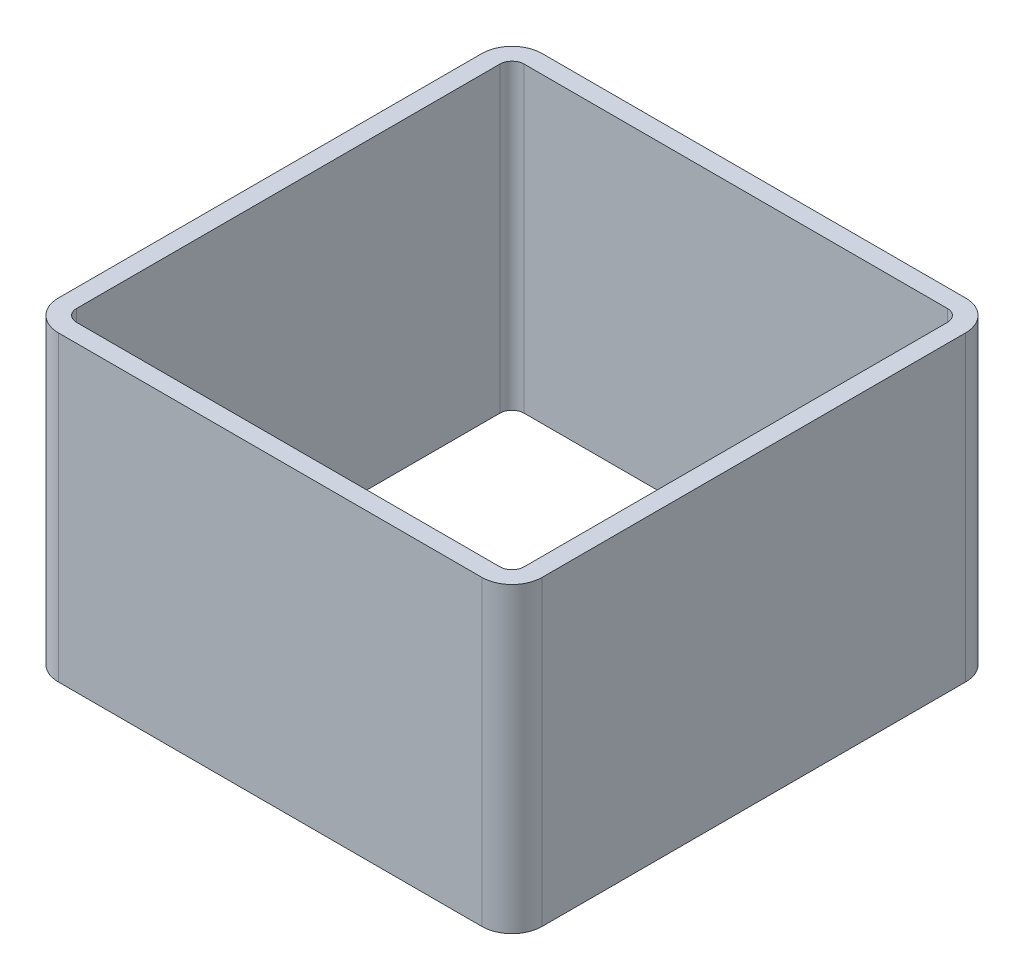
ISO-10303-21;
HEADER;
FILE_DESCRIPTION(('STEP AP214'),'2;1');
FILE_NAME('part.step','',(''),(''),'','','');
FILE_SCHEMA(('AUTOMOTIVE_DESIGN { 1 0 10303 214 1 1 1 1 }'));
ENDSEC;
DATA;
#1=APPLICATION_CONTEXT('core data for automotive mechanical design processes');
#2=APPLICATION_PROTOCOL_DEFINITION('international standard','automotive_design',2000,#1);
#3=PRODUCT_CONTEXT('',#1,'mechanical');
#4=PRODUCT('Part','Part','',(#3));
#5=PRODUCT_RELATED_PRODUCT_CATEGORY('part','',(#4));
#6=PRODUCT_DEFINITION_FORMATION('','',#4);
#7=PRODUCT_DEFINITION_CONTEXT('part definition',#1,'design');
#8=PRODUCT_DEFINITION('design','',#6,#7);
#9=PRODUCT_DEFINITION_SHAPE('','',#8);
#10=(LENGTH_UNIT() NAMED_UNIT(*) SI_UNIT(.MILLI.,.METRE.));
#11=(NAMED_UNIT(*) PLANE_ANGLE_UNIT() SI_UNIT($,.RADIAN.));
#12=(NAMED_UNIT(*) SI_UNIT($,.STERADIAN.) SOLID_ANGLE_UNIT());
#13=UNCERTAINTY_MEASURE_WITH_UNIT(LENGTH_MEASURE(1.E-05),#10,'distance_accuracy_value','');
#14=(GEOMETRIC_REPRESENTATION_CONTEXT(3) GLOBAL_UNCERTAINTY_ASSIGNED_CONTEXT((#13)) GLOBAL_UNIT_ASSIGNED_CONTEXT((#10,
#11,#12)) REPRESENTATION_CONTEXT('',''));
#15=CARTESIAN_POINT('',(0.,0.,0.));
#16=DIRECTION('',(0.,0.,1.));
#17=DIRECTION('',(1.,0.,0.));
#18=AXIS2_PLACEMENT_3D('',#15,#16,#17);
#19=CARTESIAN_POINT('',(-35.,50.,35.));
#20=DIRECTION('',(0.,1.,0.));
#21=DIRECTION('',(0.,0.,1.));
#22=AXIS2_PLACEMENT_3D('',#19,#20,#21);
#23=PLANE('',#22);
#24=CARTESIAN_POINT('',(-35.,50.,35.));
#25=DIRECTION('',(0.,1.,0.));
#26=DIRECTION('',(0.,0.,1.));
#27=AXIS2_PLACEMENT_3D('',#24,#25,#26);
#28=CIRCLE('',#27,5.);
#29=CARTESIAN_POINT('',(-40.,50.,35.));
#30=VERTEX_POINT('',#29);
#31=CARTESIAN_POINT('',(-35.,50.,40.));
#32=VERTEX_POINT('',#31);
#33=EDGE_CURVE('E290',#30,#32,#28,.T.);
#34=ORIENTED_EDGE('',*,*,#33,.T.);
#35=DIRECTION('',(1.,0.,0.));
#36=VECTOR('',#35,1.);
#37=CARTESIAN_POINT('',(-35.,50.,40.));
#38=LINE('',#37,#36);
#39=CARTESIAN_POINT('',(35.,50.,40.));
#40=VERTEX_POINT('',#39);
#41=EDGE_CURVE('E294',#32,#40,#38,.T.);
#42=ORIENTED_EDGE('',*,*,#41,.T.);
#43=CARTESIAN_POINT('',(35.,50.,35.));
#44=DIRECTION('',(0.,1.,0.));
#45=DIRECTION('',(0.,0.,1.));
#46=AXIS2_PLACEMENT_3D('',#43,#44,#45);
#47=CIRCLE('',#46,5.);
#48=CARTESIAN_POINT('',(40.,50.,35.));
#49=VERTEX_POINT('',#48);
#50=EDGE_CURVE('E298',#40,#49,#47,.T.);
#51=ORIENTED_EDGE('',*,*,#50,.T.);
#52=DIRECTION('',(0.,0.,-1.));
#53=VECTOR('',#52,1.);
#54=CARTESIAN_POINT('',(40.,50.,-35.));
#55=LINE('',#54,#53);
#56=CARTESIAN_POINT('',(40.,50.,-35.));
#57=VERTEX_POINT('',#56);
#58=EDGE_CURVE('E301',#49,#57,#55,.T.);
#59=ORIENTED_EDGE('',*,*,#58,.T.);
#60=CARTESIAN_POINT('',(35.,50.,-35.));
#61=DIRECTION('',(0.,1.,0.));
#62=DIRECTION('',(0.,0.,-1.));
#63=AXIS2_PLACEMENT_3D('',#60,#61,#62);
#64=CIRCLE('',#63,5.);
#65=CARTESIAN_POINT('',(35.,50.,-40.));
#66=VERTEX_POINT('',#65);
#67=EDGE_CURVE('E304',#57,#66,#64,.T.);
#68=ORIENTED_EDGE('',*,*,#67,.T.);
#69=DIRECTION('',(-1.,0.,0.));
#70=VECTOR('',#69,1.);
#71=CARTESIAN_POINT('',(-35.,50.,-40.));
#72=LINE('',#71,#70);
#73=CARTESIAN_POINT('',(-35.,50.,-40.));
#74=VERTEX_POINT('',#73);
#75=EDGE_CURVE('E307',#66,#74,#72,.T.);
#76=ORIENTED_EDGE('',*,*,#75,.T.);
#77=CARTESIAN_POINT('',(-35.,50.,-35.));
#78=DIRECTION('',(0.,1.,0.));
#79=DIRECTION('',(0.,0.,1.));
#80=AXIS2_PLACEMENT_3D('',#77,#78,#79);
#81=CIRCLE('',#80,5.);
#82=CARTESIAN_POINT('',(-40.,50.,-35.));
#83=VERTEX_POINT('',#82);
#84=EDGE_CURVE('E310',#74,#83,#81,.T.);
#85=ORIENTED_EDGE('',*,*,#84,.T.);
#86=DIRECTION('',(0.,0.,1.));
#87=VECTOR('',#86,1.);
#88=CARTESIAN_POINT('',(-40.,50.,-35.));
#89=LINE('',#88,#87);
#90=EDGE_CURVE('E313',#83,#30,#89,.T.);
#91=ORIENTED_EDGE('',*,*,#90,.T.);
#92=EDGE_LOOP('',(#34,#42,#51,#59,#68,#76,#85,#91));
#93=FACE_BOUND('',#92,.T.);
#94=DIRECTION('',(1.,0.,0.));
#95=VECTOR('',#94,1.);
#96=CARTESIAN_POINT('',(-35.,50.,37.));
#97=LINE('',#96,#95);
#98=CARTESIAN_POINT('',(-35.,50.,37.));
#99=VERTEX_POINT('',#98);
#100=CARTESIAN_POINT('',(35.,50.,37.));
#101=VERTEX_POINT('',#100);
#102=EDGE_CURVE('E210',#99,#101,#97,.T.);
#103=ORIENTED_EDGE('',*,*,#102,.F.);
#104=CARTESIAN_POINT('',(-35.,50.,35.));
#105=DIRECTION('',(0.,1.,0.));
#106=DIRECTION('',(1.,0.,0.));
#107=AXIS2_PLACEMENT_3D('',#104,#105,#106);
#108=CIRCLE('',#107,2.);
#109=CARTESIAN_POINT('',(-37.,50.,35.));
#110=VERTEX_POINT('',#109);
#111=EDGE_CURVE('E201',#110,#99,#108,.T.);
#112=ORIENTED_EDGE('',*,*,#111,.F.);
#113=DIRECTION('',(0.,0.,1.));
#114=VECTOR('',#113,1.);
#115=CARTESIAN_POINT('',(-37.,50.,-35.));
#116=LINE('',#115,#114);
#117=CARTESIAN_POINT('',(-37.,50.,-35.));
#118=VERTEX_POINT('',#117);
#119=EDGE_CURVE('E242',#118,#110,#116,.T.);
#120=ORIENTED_EDGE('',*,*,#119,.F.);
#121=CARTESIAN_POINT('',(-35.,50.,-35.));
#122=DIRECTION('',(0.,1.,0.));
#123=DIRECTION('',(1.,0.,0.));
#124=AXIS2_PLACEMENT_3D('',#121,#122,#123);
#125=CIRCLE('',#124,2.);
#126=CARTESIAN_POINT('',(-35.,50.,-37.));
#127=VERTEX_POINT('',#126);
#128=EDGE_CURVE('E239',#127,#118,#125,.T.);
#129=ORIENTED_EDGE('',*,*,#128,.F.);
#130=DIRECTION('',(-1.,0.,0.));
#131=VECTOR('',#130,1.);
#132=CARTESIAN_POINT('',(-35.,50.,-37.));
#133=LINE('',#132,#131);
#134=CARTESIAN_POINT('',(35.,50.,-37.));
#135=VERTEX_POINT('',#134);
#136=EDGE_CURVE('E236',#135,#127,#133,.T.);
#137=ORIENTED_EDGE('',*,*,#136,.F.);
#138=CARTESIAN_POINT('',(35.,50.,-35.));
#139=DIRECTION('',(0.,1.,0.));
#140=DIRECTION('',(1.,0.,0.));
#141=AXIS2_PLACEMENT_3D('',#138,#139,#140);
#142=CIRCLE('',#141,2.);
#143=CARTESIAN_POINT('',(37.,50.,-35.));
#144=VERTEX_POINT('',#143);
#145=EDGE_CURVE('E233',#144,#135,#142,.T.);
#146=ORIENTED_EDGE('',*,*,#145,.F.);
#147=DIRECTION('',(0.,0.,-1.));
#148=VECTOR('',#147,1.);
#149=CARTESIAN_POINT('',(37.,50.,-35.));
#150=LINE('',#149,#148);
#151=CARTESIAN_POINT('',(37.,50.,35.));
#152=VERTEX_POINT('',#151);
#153=EDGE_CURVE('E228',#152,#144,#150,.T.);
#154=ORIENTED_EDGE('',*,*,#153,.F.);
#155=CARTESIAN_POINT('',(35.,50.,35.));
#156=DIRECTION('',(0.,1.,0.));
#157=DIRECTION('',(1.,0.,0.));
#158=AXIS2_PLACEMENT_3D('',#155,#156,#157);
#159=CIRCLE('',#158,2.);
#160=EDGE_CURVE('E224',#101,#152,#159,.T.);
#161=ORIENTED_EDGE('',*,*,#160,.F.);
#162=EDGE_LOOP('',(#103,#112,#120,#129,#137,#146,#154,#161));
#163=FACE_BOUND('',#162,.T.);
#164=ADVANCED_FACE('F87',(#93,#163),#23,.T.);
#165=CARTESIAN_POINT('',(-35.,0.,35.));
#166=DIRECTION('',(0.,1.,0.));
#167=DIRECTION('',(0.,0.,1.));
#168=AXIS2_PLACEMENT_3D('',#165,#166,#167);
#169=PLANE('',#168);
#170=CARTESIAN_POINT('',(-35.,0.,35.));
#171=DIRECTION('',(0.,1.,0.));
#172=DIRECTION('',(0.,0.,1.));
#173=AXIS2_PLACEMENT_3D('',#170,#171,#172);
#174=CIRCLE('',#173,5.);
#175=CARTESIAN_POINT('',(-40.,0.,35.));
#176=VERTEX_POINT('',#175);
#177=CARTESIAN_POINT('',(-35.,0.,40.));
#178=VERTEX_POINT('',#177);
#179=EDGE_CURVE('E219',#176,#178,#174,.T.);
#180=ORIENTED_EDGE('',*,*,#179,.F.);
#181=DIRECTION('',(0.,0.,1.));
#182=VECTOR('',#181,1.);
#183=CARTESIAN_POINT('',(-40.,0.,-35.));
#184=LINE('',#183,#182);
#185=CARTESIAN_POINT('',(-40.,0.,-35.));
#186=VERTEX_POINT('',#185);
#187=EDGE_CURVE('E295',#186,#176,#184,.T.);
#188=ORIENTED_EDGE('',*,*,#187,.F.);
#189=CARTESIAN_POINT('',(-35.,0.,-35.));
#190=DIRECTION('',(0.,1.,0.));
#191=DIRECTION('',(0.,0.,1.));
#192=AXIS2_PLACEMENT_3D('',#189,#190,#191);
#193=CIRCLE('',#192,5.);
#194=CARTESIAN_POINT('',(-35.,0.,-40.));
#195=VERTEX_POINT('',#194);
#196=EDGE_CURVE('E335',#195,#186,#193,.T.);
#197=ORIENTED_EDGE('',*,*,#196,.F.);
#198=DIRECTION('',(-1.,0.,0.));
#199=VECTOR('',#198,1.);
#200=CARTESIAN_POINT('',(-35.,0.,-40.));
#201=LINE('',#200,#199);
#202=CARTESIAN_POINT('',(35.,0.,-40.));
#203=VERTEX_POINT('',#202);
#204=EDGE_CURVE('E332',#203,#195,#201,.T.);
#205=ORIENTED_EDGE('',*,*,#204,.F.);
#206=CARTESIAN_POINT('',(35.,0.,-35.));
#207=DIRECTION('',(0.,1.,0.));
#208=DIRECTION('',(0.,0.,-1.));
#209=AXIS2_PLACEMENT_3D('',#206,#207,#208);
#210=CIRCLE('',#209,5.);
#211=CARTESIAN_POINT('',(40.,0.,-35.));
#212=VERTEX_POINT('',#211);
#213=EDGE_CURVE('E329',#212,#203,#210,.T.);
#214=ORIENTED_EDGE('',*,*,#213,.F.);
#215=DIRECTION('',(0.,0.,-1.));
#216=VECTOR('',#215,1.);
#217=CARTESIAN_POINT('',(40.,0.,-35.));
#218=LINE('',#217,#216);
#219=CARTESIAN_POINT('',(40.,0.,35.));
#220=VERTEX_POINT('',#219);
#221=EDGE_CURVE('E326',#220,#212,#218,.T.);
#222=ORIENTED_EDGE('',*,*,#221,.F.);
#223=CARTESIAN_POINT('',(35.,0.,35.));
#224=DIRECTION('',(0.,1.,0.));
#225=DIRECTION('',(0.,0.,1.));
#226=AXIS2_PLACEMENT_3D('',#223,#224,#225);
#227=CIRCLE('',#226,5.);
#228=CARTESIAN_POINT('',(35.,0.,40.));
#229=VERTEX_POINT('',#228);
#230=EDGE_CURVE('E323',#229,#220,#227,.T.);
#231=ORIENTED_EDGE('',*,*,#230,.F.);
#232=DIRECTION('',(1.,0.,0.));
#233=VECTOR('',#232,1.);
#234=CARTESIAN_POINT('',(-35.,0.,40.));
#235=LINE('',#234,#233);
#236=EDGE_CURVE('E320',#178,#229,#235,.T.);
#237=ORIENTED_EDGE('',*,*,#236,.F.);
#238=EDGE_LOOP('',(#180,#188,#197,#205,#214,#222,#231,#237));
#239=FACE_BOUND('',#238,.T.);
#240=CARTESIAN_POINT('',(-35.,0.,35.));
#241=DIRECTION('',(0.,1.,0.));
#242=DIRECTION('',(1.,0.,0.));
#243=AXIS2_PLACEMENT_3D('',#240,#241,#242);
#244=CIRCLE('',#243,2.);
#245=CARTESIAN_POINT('',(-37.,0.,35.));
#246=VERTEX_POINT('',#245);
#247=CARTESIAN_POINT('',(-35.,0.,37.));
#248=VERTEX_POINT('',#247);
#249=EDGE_CURVE('E111',#246,#248,#244,.T.);
#250=ORIENTED_EDGE('',*,*,#249,.T.);
#251=DIRECTION('',(1.,0.,0.));
#252=VECTOR('',#251,1.);
#253=CARTESIAN_POINT('',(-35.,0.,37.));
#254=LINE('',#253,#252);
#255=CARTESIAN_POINT('',(35.,0.,37.));
#256=VERTEX_POINT('',#255);
#257=EDGE_CURVE('E217',#248,#256,#254,.T.);
#258=ORIENTED_EDGE('',*,*,#257,.T.);
#259=CARTESIAN_POINT('',(35.,0.,35.));
#260=DIRECTION('',(0.,1.,0.));
#261=DIRECTION('',(1.,0.,0.));
#262=AXIS2_PLACEMENT_3D('',#259,#260,#261);
#263=CIRCLE('',#262,2.);
#264=CARTESIAN_POINT('',(37.,0.,35.));
#265=VERTEX_POINT('',#264);
#266=EDGE_CURVE('E249',#256,#265,#263,.T.);
#267=ORIENTED_EDGE('',*,*,#266,.T.);
#268=DIRECTION('',(0.,0.,-1.));
#269=VECTOR('',#268,1.);
#270=CARTESIAN_POINT('',(37.,0.,-35.));
#271=LINE('',#270,#269);
#272=CARTESIAN_POINT('',(37.,0.,-35.));
#273=VERTEX_POINT('',#272);
#274=EDGE_CURVE('E253',#265,#273,#271,.T.);
#275=ORIENTED_EDGE('',*,*,#274,.T.);
#276=CARTESIAN_POINT('',(35.,0.,-35.));
#277=DIRECTION('',(0.,1.,0.));
#278=DIRECTION('',(1.,0.,0.));
#279=AXIS2_PLACEMENT_3D('',#276,#277,#278);
#280=CIRCLE('',#279,2.);
#281=CARTESIAN_POINT('',(35.,0.,-37.));
#282=VERTEX_POINT('',#281);
#283=EDGE_CURVE('E257',#273,#282,#280,.T.);
#284=ORIENTED_EDGE('',*,*,#283,.T.);
#285=DIRECTION('',(-1.,0.,0.));
#286=VECTOR('',#285,1.);
#287=CARTESIAN_POINT('',(-35.,0.,-37.));
#288=LINE('',#287,#286);
#289=CARTESIAN_POINT('',(-35.,0.,-37.));
#290=VERTEX_POINT('',#289);
#291=EDGE_CURVE('E261',#282,#290,#288,.T.);
#292=ORIENTED_EDGE('',*,*,#291,.T.);
#293=CARTESIAN_POINT('',(-35.,0.,-35.));
#294=DIRECTION('',(0.,1.,0.));
#295=DIRECTION('',(1.,0.,0.));
#296=AXIS2_PLACEMENT_3D('',#293,#294,#295);
#297=CIRCLE('',#296,2.);
#298=CARTESIAN_POINT('',(-37.,0.,-35.));
#299=VERTEX_POINT('',#298);
#300=EDGE_CURVE('E265',#290,#299,#297,.T.);
#301=ORIENTED_EDGE('',*,*,#300,.T.);
#302=DIRECTION('',(0.,0.,1.));
#303=VECTOR('',#302,1.);
#304=CARTESIAN_POINT('',(-37.,0.,-35.));
#305=LINE('',#304,#303);
#306=EDGE_CURVE('E211',#299,#246,#305,.T.);
#307=ORIENTED_EDGE('',*,*,#306,.T.);
#308=EDGE_LOOP('',(#250,#258,#267,#275,#284,#292,#301,#307));
#309=FACE_BOUND('',#308,.T.);
#310=ADVANCED_FACE('F374',(#239,#309),#169,.F.);
#311=CARTESIAN_POINT('',(-35.,50.,35.));
#312=DIRECTION('',(0.,-1.,0.));
#313=DIRECTION('',(0.,0.,-1.));
#314=AXIS2_PLACEMENT_3D('',#311,#312,#313);
#315=CYLINDRICAL_SURFACE('',#314,5.);
#316=ORIENTED_EDGE('',*,*,#179,.T.);
#317=DIRECTION('',(0.,-1.,0.));
#318=VECTOR('',#317,1.);
#319=CARTESIAN_POINT('',(-35.,50.,40.));
#320=LINE('',#319,#318);
#321=EDGE_CURVE('E12',#32,#178,#320,.T.);
#322=ORIENTED_EDGE('',*,*,#321,.F.);
#323=ORIENTED_EDGE('',*,*,#33,.F.);
#324=DIRECTION('',(0.,-1.,0.));
#325=VECTOR('',#324,1.);
#326=CARTESIAN_POINT('',(-40.,50.,35.));
#327=LINE('',#326,#325);
#328=EDGE_CURVE('E316',#30,#176,#327,.T.);
#329=ORIENTED_EDGE('',*,*,#328,.T.);
#330=EDGE_LOOP('',(#316,#322,#323,#329));
#331=FACE_BOUND('',#330,.T.);
#332=ADVANCED_FACE('F89',(#331),#315,.T.);
#333=CARTESIAN_POINT('',(-35.,50.,40.));
#334=DIRECTION('',(0.,0.,-1.));
#335=DIRECTION('',(-1.,0.,0.));
#336=AXIS2_PLACEMENT_3D('',#333,#334,#335);
#337=PLANE('',#336);
#338=ORIENTED_EDGE('',*,*,#236,.T.);
#339=DIRECTION('',(0.,-1.,0.));
#340=VECTOR('',#339,1.);
#341=CARTESIAN_POINT('',(35.,50.,40.));
#342=LINE('',#341,#340);
#343=EDGE_CURVE('E96',#40,#229,#342,.T.);
#344=ORIENTED_EDGE('',*,*,#343,.F.);
#345=ORIENTED_EDGE('',*,*,#41,.F.);
#346=ORIENTED_EDGE('',*,*,#321,.T.);
#347=EDGE_LOOP('',(#338,#344,#345,#346));
#348=FACE_BOUND('',#347,.T.);
#349=ADVANCED_FACE('F391',(#348),#337,.F.);
#350=CARTESIAN_POINT('',(35.,50.,35.));
#351=DIRECTION('',(0.,-1.,0.));
#352=DIRECTION('',(0.,0.,-1.));
#353=AXIS2_PLACEMENT_3D('',#350,#351,#352);
#354=CYLINDRICAL_SURFACE('',#353,5.);
#355=ORIENTED_EDGE('',*,*,#230,.T.);
#356=DIRECTION('',(0.,-1.,0.));
#357=VECTOR('',#356,1.);
#358=CARTESIAN_POINT('',(40.,50.,35.));
#359=LINE('',#358,#357);
#360=EDGE_CURVE('E359',#49,#220,#359,.T.);
#361=ORIENTED_EDGE('',*,*,#360,.F.);
#362=ORIENTED_EDGE('',*,*,#50,.F.);
#363=ORIENTED_EDGE('',*,*,#343,.T.);
#364=EDGE_LOOP('',(#355,#361,#362,#363));
#365=FACE_BOUND('',#364,.T.);
#366=ADVANCED_FACE('F368',(#365),#354,.T.);
#367=CARTESIAN_POINT('',(40.,50.,-35.));
#368=DIRECTION('',(-1.,0.,0.));
#369=DIRECTION('',(0.,0.,1.));
#370=AXIS2_PLACEMENT_3D('',#367,#368,#369);
#371=PLANE('',#370);
#372=ORIENTED_EDGE('',*,*,#221,.T.);
#373=DIRECTION('',(0.,-1.,0.));
#374=VECTOR('',#373,1.);
#375=CARTESIAN_POINT('',(40.,50.,-35.));
#376=LINE('',#375,#374);
#377=EDGE_CURVE('E355',#57,#212,#376,.T.);
#378=ORIENTED_EDGE('',*,*,#377,.F.);
#379=ORIENTED_EDGE('',*,*,#58,.F.);
#380=ORIENTED_EDGE('',*,*,#360,.T.);
#381=EDGE_LOOP('',(#372,#378,#379,#380));
#382=FACE_BOUND('',#381,.T.);
#383=ADVANCED_FACE('F380',(#382),#371,.F.);
#384=CARTESIAN_POINT('',(35.,50.,-35.));
#385=DIRECTION('',(0.,-1.,0.));
#386=DIRECTION('',(0.,0.,-1.));
#387=AXIS2_PLACEMENT_3D('',#384,#385,#386);
#388=CYLINDRICAL_SURFACE('',#387,5.);
#389=ORIENTED_EDGE('',*,*,#213,.T.);
#390=DIRECTION('',(0.,-1.,0.));
#391=VECTOR('',#390,1.);
#392=CARTESIAN_POINT('',(35.,50.,-40.));
#393=LINE('',#392,#391);
#394=EDGE_CURVE('E351',#66,#203,#393,.T.);
#395=ORIENTED_EDGE('',*,*,#394,.F.);
#396=ORIENTED_EDGE('',*,*,#67,.F.);
#397=ORIENTED_EDGE('',*,*,#377,.T.);
#398=EDGE_LOOP('',(#389,#395,#396,#397));
#399=FACE_BOUND('',#398,.T.);
#400=ADVANCED_FACE('F384',(#399),#388,.T.);
#401=CARTESIAN_POINT('',(-35.,50.,-40.));
#402=DIRECTION('',(0.,0.,1.));
#403=DIRECTION('',(1.,0.,0.));
#404=AXIS2_PLACEMENT_3D('',#401,#402,#403);
#405=PLANE('',#404);
#406=ORIENTED_EDGE('',*,*,#204,.T.);
#407=DIRECTION('',(0.,-1.,0.));
#408=VECTOR('',#407,1.);
#409=CARTESIAN_POINT('',(-35.,50.,-40.));
#410=LINE('',#409,#408);
#411=EDGE_CURVE('E347',#74,#195,#410,.T.);
#412=ORIENTED_EDGE('',*,*,#411,.F.);
#413=ORIENTED_EDGE('',*,*,#75,.F.);
#414=ORIENTED_EDGE('',*,*,#394,.T.);
#415=EDGE_LOOP('',(#406,#412,#413,#414));
#416=FACE_BOUND('',#415,.T.);
#417=ADVANCED_FACE('F404',(#416),#405,.F.);
#418=CARTESIAN_POINT('',(-35.,50.,-35.));
#419=DIRECTION('',(0.,-1.,0.));
#420=DIRECTION('',(0.,0.,-1.));
#421=AXIS2_PLACEMENT_3D('',#418,#419,#420);
#422=CYLINDRICAL_SURFACE('',#421,5.);
#423=ORIENTED_EDGE('',*,*,#196,.T.);
#424=DIRECTION('',(0.,-1.,0.));
#425=VECTOR('',#424,1.);
#426=CARTESIAN_POINT('',(-40.,50.,-35.));
#427=LINE('',#426,#425);
#428=EDGE_CURVE('E343',#83,#186,#427,.T.);
#429=ORIENTED_EDGE('',*,*,#428,.F.);
#430=ORIENTED_EDGE('',*,*,#84,.F.);
#431=ORIENTED_EDGE('',*,*,#411,.T.);
#432=EDGE_LOOP('',(#423,#429,#430,#431));
#433=FACE_BOUND('',#432,.T.);
#434=ADVANCED_FACE('F402',(#433),#422,.T.);
#435=CARTESIAN_POINT('',(-40.,50.,-35.));
#436=DIRECTION('',(1.,0.,0.));
#437=DIRECTION('',(0.,0.,-1.));
#438=AXIS2_PLACEMENT_3D('',#435,#436,#437);
#439=PLANE('',#438);
#440=ORIENTED_EDGE('',*,*,#187,.T.);
#441=ORIENTED_EDGE('',*,*,#328,.F.);
#442=ORIENTED_EDGE('',*,*,#90,.F.);
#443=ORIENTED_EDGE('',*,*,#428,.T.);
#444=EDGE_LOOP('',(#440,#441,#442,#443));
#445=FACE_BOUND('',#444,.T.);
#446=ADVANCED_FACE('F397',(#445),#439,.F.);
#447=CARTESIAN_POINT('',(-35.,50.,35.));
#448=DIRECTION('',(0.,-1.,0.));
#449=DIRECTION('',(0.,0.,-1.));
#450=AXIS2_PLACEMENT_3D('',#447,#448,#449);
#451=CYLINDRICAL_SURFACE('',#450,2.);
#452=ORIENTED_EDGE('',*,*,#249,.F.);
#453=DIRECTION('',(0.,-1.,0.));
#454=VECTOR('',#453,1.);
#455=CARTESIAN_POINT('',(-37.,50.,35.));
#456=LINE('',#455,#454);
#457=EDGE_CURVE('E205',#110,#246,#456,.T.);
#458=ORIENTED_EDGE('',*,*,#457,.F.);
#459=ORIENTED_EDGE('',*,*,#111,.T.);
#460=DIRECTION('',(0.,-1.,0.));
#461=VECTOR('',#460,1.);
#462=CARTESIAN_POINT('',(-35.,50.,37.));
#463=LINE('',#462,#461);
#464=EDGE_CURVE('E204',#99,#248,#463,.T.);
#465=ORIENTED_EDGE('',*,*,#464,.T.);
#466=EDGE_LOOP('',(#452,#458,#459,#465));
#467=FACE_BOUND('',#466,.T.);
#468=ADVANCED_FACE('F203',(#467),#451,.F.);
#469=CARTESIAN_POINT('',(-35.,50.,37.));
#470=DIRECTION('',(0.,0.,-1.));
#471=DIRECTION('',(-1.,0.,0.));
#472=AXIS2_PLACEMENT_3D('',#469,#470,#471);
#473=PLANE('',#472);
#474=ORIENTED_EDGE('',*,*,#257,.F.);
#475=ORIENTED_EDGE('',*,*,#464,.F.);
#476=ORIENTED_EDGE('',*,*,#102,.T.);
#477=DIRECTION('',(0.,-1.,0.));
#478=VECTOR('',#477,1.);
#479=CARTESIAN_POINT('',(35.,50.,37.));
#480=LINE('',#479,#478);
#481=EDGE_CURVE('E220',#101,#256,#480,.T.);
#482=ORIENTED_EDGE('',*,*,#481,.T.);
#483=EDGE_LOOP('',(#474,#475,#476,#482));
#484=FACE_BOUND('',#483,.T.);
#485=ADVANCED_FACE('F214',(#484),#473,.T.);
#486=CARTESIAN_POINT('',(35.,50.,35.));
#487=DIRECTION('',(0.,-1.,0.));
#488=DIRECTION('',(0.,0.,-1.));
#489=AXIS2_PLACEMENT_3D('',#486,#487,#488);
#490=CYLINDRICAL_SURFACE('',#489,2.);
#491=ORIENTED_EDGE('',*,*,#266,.F.);
#492=ORIENTED_EDGE('',*,*,#481,.F.);
#493=ORIENTED_EDGE('',*,*,#160,.T.);
#494=DIRECTION('',(0.,-1.,0.));
#495=VECTOR('',#494,1.);
#496=CARTESIAN_POINT('',(37.,50.,35.));
#497=LINE('',#496,#495);
#498=EDGE_CURVE('E285',#152,#265,#497,.T.);
#499=ORIENTED_EDGE('',*,*,#498,.T.);
#500=EDGE_LOOP('',(#491,#492,#493,#499));
#501=FACE_BOUND('',#500,.T.);
#502=ADVANCED_FACE('F429',(#501),#490,.F.);
#503=CARTESIAN_POINT('',(37.,50.,-35.));
#504=DIRECTION('',(-1.,0.,0.));
#505=DIRECTION('',(0.,0.,1.));
#506=AXIS2_PLACEMENT_3D('',#503,#504,#505);
#507=PLANE('',#506);
#508=ORIENTED_EDGE('',*,*,#274,.F.);
#509=ORIENTED_EDGE('',*,*,#498,.F.);
#510=ORIENTED_EDGE('',*,*,#153,.T.);
#511=DIRECTION('',(0.,-1.,0.));
#512=VECTOR('',#511,1.);
#513=CARTESIAN_POINT('',(37.,50.,-35.));
#514=LINE('',#513,#512);
#515=EDGE_CURVE('E282',#144,#273,#514,.T.);
#516=ORIENTED_EDGE('',*,*,#515,.T.);
#517=EDGE_LOOP('',(#508,#509,#510,#516));
#518=FACE_BOUND('',#517,.T.);
#519=ADVANCED_FACE('F433',(#518),#507,.T.);
#520=CARTESIAN_POINT('',(35.,50.,-35.));
#521=DIRECTION('',(0.,-1.,0.));
#522=DIRECTION('',(0.,0.,-1.));
#523=AXIS2_PLACEMENT_3D('',#520,#521,#522);
#524=CYLINDRICAL_SURFACE('',#523,2.);
#525=ORIENTED_EDGE('',*,*,#283,.F.);
#526=ORIENTED_EDGE('',*,*,#515,.F.);
#527=ORIENTED_EDGE('',*,*,#145,.T.);
#528=DIRECTION('',(0.,-1.,0.));
#529=VECTOR('',#528,1.);
#530=CARTESIAN_POINT('',(35.,50.,-37.));
#531=LINE('',#530,#529);
#532=EDGE_CURVE('E279',#135,#282,#531,.T.);
#533=ORIENTED_EDGE('',*,*,#532,.T.);
#534=EDGE_LOOP('',(#525,#526,#527,#533));
#535=FACE_BOUND('',#534,.T.);
#536=ADVANCED_FACE('F439',(#535),#524,.F.);
#537=CARTESIAN_POINT('',(-35.,50.,-37.));
#538=DIRECTION('',(0.,0.,1.));
#539=DIRECTION('',(1.,0.,0.));
#540=AXIS2_PLACEMENT_3D('',#537,#538,#539);
#541=PLANE('',#540);
#542=ORIENTED_EDGE('',*,*,#291,.F.);
#543=ORIENTED_EDGE('',*,*,#532,.F.);
#544=ORIENTED_EDGE('',*,*,#136,.T.);
#545=DIRECTION('',(0.,-1.,0.));
#546=VECTOR('',#545,1.);
#547=CARTESIAN_POINT('',(-35.,50.,-37.));
#548=LINE('',#547,#546);
#549=EDGE_CURVE('E276',#127,#290,#548,.T.);
#550=ORIENTED_EDGE('',*,*,#549,.T.);
#551=EDGE_LOOP('',(#542,#543,#544,#550));
#552=FACE_BOUND('',#551,.T.);
#553=ADVANCED_FACE('F443',(#552),#541,.T.);
#554=CARTESIAN_POINT('',(-35.,50.,-35.));
#555=DIRECTION('',(0.,-1.,0.));
#556=DIRECTION('',(0.,0.,-1.));
#557=AXIS2_PLACEMENT_3D('',#554,#555,#556);
#558=CYLINDRICAL_SURFACE('',#557,2.);
#559=ORIENTED_EDGE('',*,*,#300,.F.);
#560=ORIENTED_EDGE('',*,*,#549,.F.);
#561=ORIENTED_EDGE('',*,*,#128,.T.);
#562=DIRECTION('',(0.,-1.,0.));
#563=VECTOR('',#562,1.);
#564=CARTESIAN_POINT('',(-37.,50.,-35.));
#565=LINE('',#564,#563);
#566=EDGE_CURVE('E103',#118,#299,#565,.T.);
#567=ORIENTED_EDGE('',*,*,#566,.T.);
#568=EDGE_LOOP('',(#559,#560,#561,#567));
#569=FACE_BOUND('',#568,.T.);
#570=ADVANCED_FACE('F447',(#569),#558,.F.);
#571=CARTESIAN_POINT('',(-37.,50.,-35.));
#572=DIRECTION('',(1.,0.,0.));
#573=DIRECTION('',(0.,0.,-1.));
#574=AXIS2_PLACEMENT_3D('',#571,#572,#573);
#575=PLANE('',#574);
#576=ORIENTED_EDGE('',*,*,#306,.F.);
#577=ORIENTED_EDGE('',*,*,#566,.F.);
#578=ORIENTED_EDGE('',*,*,#119,.T.);
#579=ORIENTED_EDGE('',*,*,#457,.T.);
#580=EDGE_LOOP('',(#576,#577,#578,#579));
#581=FACE_BOUND('',#580,.T.);
#582=ADVANCED_FACE('F451',(#581),#575,.T.);
#583=CLOSED_SHELL('',(#164,#310,#332,#349,#366,#383,#400,#417,#434,#446,#468,#485,#502,#519,
#536,#553,#570,#582));
#584=MANIFOLD_SOLID_BREP('B2',#583);
#585=ADVANCED_BREP_SHAPE_REPRESENTATION('',(#18,#584),#14);
#586=SHAPE_DEFINITION_REPRESENTATION(#9,#585);
ENDSEC;
END-ISO-10303-21;
